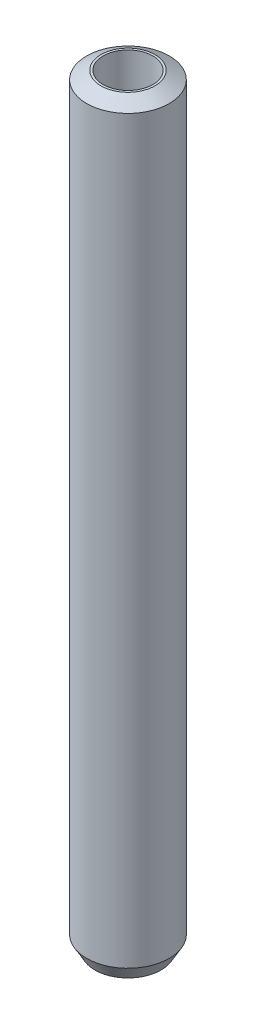
ISO-10303-21;
HEADER;
FILE_DESCRIPTION(('STEP AP214'),'2;1');
FILE_NAME('part.step','',(''),(''),'','','');
FILE_SCHEMA(('AUTOMOTIVE_DESIGN { 1 0 10303 214 1 1 1 1 }'));
ENDSEC;
DATA;
#1=APPLICATION_CONTEXT('core data for automotive mechanical design processes');
#2=APPLICATION_PROTOCOL_DEFINITION('international standard','automotive_design',2000,#1);
#3=PRODUCT_CONTEXT('',#1,'mechanical');
#4=PRODUCT('Part','Part','',(#3));
#5=PRODUCT_RELATED_PRODUCT_CATEGORY('part','',(#4));
#6=PRODUCT_DEFINITION_FORMATION('','',#4);
#7=PRODUCT_DEFINITION_CONTEXT('part definition',#1,'design');
#8=PRODUCT_DEFINITION('design','',#6,#7);
#9=PRODUCT_DEFINITION_SHAPE('','',#8);
#10=(LENGTH_UNIT() NAMED_UNIT(*) SI_UNIT(.MILLI.,.METRE.));
#11=(NAMED_UNIT(*) PLANE_ANGLE_UNIT() SI_UNIT($,.RADIAN.));
#12=(NAMED_UNIT(*) SI_UNIT($,.STERADIAN.) SOLID_ANGLE_UNIT());
#13=UNCERTAINTY_MEASURE_WITH_UNIT(LENGTH_MEASURE(1.E-05),#10,'distance_accuracy_value','');
#14=(GEOMETRIC_REPRESENTATION_CONTEXT(3) GLOBAL_UNCERTAINTY_ASSIGNED_CONTEXT((#13)) GLOBAL_UNIT_ASSIGNED_CONTEXT((#10,
#11,#12)) REPRESENTATION_CONTEXT('',''));
#15=CARTESIAN_POINT('',(0.,0.,0.));
#16=DIRECTION('',(0.,0.,1.));
#17=DIRECTION('',(1.,0.,0.));
#18=AXIS2_PLACEMENT_3D('',#15,#16,#17);
#19=CARTESIAN_POINT('',(0.,323.305458173561,0.));
#20=DIRECTION('',(0.,-1.,0.));
#21=DIRECTION('',(0.,0.,-1.));
#22=AXIS2_PLACEMENT_3D('',#19,#20,#21);
#23=CYLINDRICAL_SURFACE('',#22,17.5);
#24=CARTESIAN_POINT('',(0.,319.822501281497,0.));
#25=DIRECTION('',(0.,1.,0.));
#26=DIRECTION('',(0.,0.,1.));
#27=AXIS2_PLACEMENT_3D('',#24,#25,#26);
#28=CIRCLE('',#27,17.5);
#29=CARTESIAN_POINT('',(0.,319.822501281497,17.5));
#30=VERTEX_POINT('',#29);
#31=EDGE_CURVE('E50',#30,#30,#28,.F.);
#32=ORIENTED_EDGE('',*,*,#31,.T.);
#33=EDGE_LOOP('',(#32));
#34=FACE_BOUND('',#33,.T.);
#35=CARTESIAN_POINT('',(0.,6.03265829762717,0.));
#36=DIRECTION('',(0.,1.,0.));
#37=DIRECTION('',(0.,0.,1.));
#38=AXIS2_PLACEMENT_3D('',#35,#36,#37);
#39=CIRCLE('',#38,17.5);
#40=CARTESIAN_POINT('',(0.,6.03265829762717,17.5));
#41=VERTEX_POINT('',#40);
#42=EDGE_CURVE('E51',#41,#41,#39,.T.);
#43=ORIENTED_EDGE('',*,*,#42,.T.);
#44=EDGE_LOOP('',(#43));
#45=FACE_BOUND('',#44,.T.);
#46=ADVANCED_FACE('F39',(#34,#45),#23,.T.);
#47=CARTESIAN_POINT('',(0.,323.305458173561,0.));
#48=DIRECTION('',(0.,1.,0.));
#49=DIRECTION('',(0.,0.,1.));
#50=AXIS2_PLACEMENT_3D('',#47,#48,#49);
#51=PLANE('',#50);
#52=CARTESIAN_POINT('',(0.,323.305458173561,0.));
#53=DIRECTION('',(0.,1.,0.));
#54=DIRECTION('',(0.,0.,1.));
#55=AXIS2_PLACEMENT_3D('',#52,#53,#54);
#56=CIRCLE('',#55,11.4673417023727);
#57=CARTESIAN_POINT('',(0.,323.305458173561,11.4673417023727));
#58=VERTEX_POINT('',#57);
#59=EDGE_CURVE('E54',#58,#58,#56,.T.);
#60=ORIENTED_EDGE('',*,*,#59,.T.);
#61=EDGE_LOOP('',(#60));
#62=FACE_BOUND('',#61,.T.);
#63=CARTESIAN_POINT('',(0.,323.305458173561,0.));
#64=DIRECTION('',(0.,1.,0.));
#65=DIRECTION('',(0.,0.,1.));
#66=AXIS2_PLACEMENT_3D('',#63,#64,#65);
#67=CIRCLE('',#66,10.5337515291915);
#68=CARTESIAN_POINT('',(0.,323.305458173561,10.5337515291915));
#69=VERTEX_POINT('',#68);
#70=EDGE_CURVE('E58',#69,#69,#67,.T.);
#71=ORIENTED_EDGE('',*,*,#70,.F.);
#72=EDGE_LOOP('',(#71));
#73=FACE_BOUND('',#72,.T.);
#74=ADVANCED_FACE('F69',(#62,#73),#51,.T.);
#75=CARTESIAN_POINT('',(0.,0.,0.));
#76=DIRECTION('',(0.,1.,0.));
#77=DIRECTION('',(0.,0.,1.));
#78=AXIS2_PLACEMENT_3D('',#75,#76,#77);
#79=PLANE('',#78);
#80=CARTESIAN_POINT('',(0.,0.,0.));
#81=DIRECTION('',(0.,1.,0.));
#82=DIRECTION('',(0.,0.,1.));
#83=AXIS2_PLACEMENT_3D('',#80,#81,#82);
#84=CIRCLE('',#83,14.0170431079359);
#85=CARTESIAN_POINT('',(0.,0.,14.0170431079359));
#86=VERTEX_POINT('',#85);
#87=EDGE_CURVE('E10',#86,#86,#84,.F.);
#88=ORIENTED_EDGE('',*,*,#87,.T.);
#89=EDGE_LOOP('',(#88));
#90=FACE_BOUND('',#89,.T.);
#91=CARTESIAN_POINT('',(0.,0.,0.));
#92=DIRECTION('',(0.,1.,0.));
#93=DIRECTION('',(0.,0.,1.));
#94=AXIS2_PLACEMENT_3D('',#91,#92,#93);
#95=CIRCLE('',#94,10.5337515291915);
#96=CARTESIAN_POINT('',(0.,0.,10.5337515291915));
#97=VERTEX_POINT('',#96);
#98=EDGE_CURVE('E63',#97,#97,#95,.T.);
#99=ORIENTED_EDGE('',*,*,#98,.T.);
#100=EDGE_LOOP('',(#99));
#101=FACE_BOUND('',#100,.T.);
#102=ADVANCED_FACE('F75',(#90,#101),#79,.F.);
#103=CARTESIAN_POINT('',(0.,323.305458173561,0.));
#104=DIRECTION('',(0.,-1.,0.));
#105=DIRECTION('',(0.,0.,-1.));
#106=AXIS2_PLACEMENT_3D('',#103,#104,#105);
#107=CYLINDRICAL_SURFACE('',#106,10.5337515291915);
#108=ORIENTED_EDGE('',*,*,#70,.T.);
#109=EDGE_LOOP('',(#108));
#110=FACE_BOUND('',#109,.T.);
#111=ORIENTED_EDGE('',*,*,#98,.F.);
#112=EDGE_LOOP('',(#111));
#113=FACE_BOUND('',#112,.T.);
#114=ADVANCED_FACE('F70',(#110,#113),#107,.F.);
#115=CARTESIAN_POINT('',(0.,323.305458173561,0.));
#116=DIRECTION('',(0.,-1.,0.));
#117=DIRECTION('',(0.,0.,-1.));
#118=AXIS2_PLACEMENT_3D('',#115,#116,#117);
#119=CONICAL_SURFACE('',#118,11.4673417023727,1.04719755119658);
#120=ORIENTED_EDGE('',*,*,#31,.F.);
#121=EDGE_LOOP('',(#120));
#122=FACE_BOUND('',#121,.T.);
#123=ORIENTED_EDGE('',*,*,#59,.F.);
#124=EDGE_LOOP('',(#123));
#125=FACE_BOUND('',#124,.T.);
#126=ADVANCED_FACE('F81',(#122,#125),#119,.T.);
#127=CARTESIAN_POINT('',(0.,6.03265829762717,0.));
#128=DIRECTION('',(0.,1.,0.));
#129=DIRECTION('',(0.,0.,1.));
#130=AXIS2_PLACEMENT_3D('',#127,#128,#129);
#131=CONICAL_SURFACE('',#130,17.5,0.523598775598297);
#132=ORIENTED_EDGE('',*,*,#87,.F.);
#133=EDGE_LOOP('',(#132));
#134=FACE_BOUND('',#133,.T.);
#135=ORIENTED_EDGE('',*,*,#42,.F.);
#136=EDGE_LOOP('',(#135));
#137=FACE_BOUND('',#136,.T.);
#138=ADVANCED_FACE('F45',(#134,#137),#131,.T.);
#139=CLOSED_SHELL('',(#46,#74,#102,#114,#126,#138));
#140=MANIFOLD_SOLID_BREP('B2',#139);
#141=ADVANCED_BREP_SHAPE_REPRESENTATION('',(#18,#140),#14);
#142=SHAPE_DEFINITION_REPRESENTATION(#9,#141);
ENDSEC;
END-ISO-10303-21;
